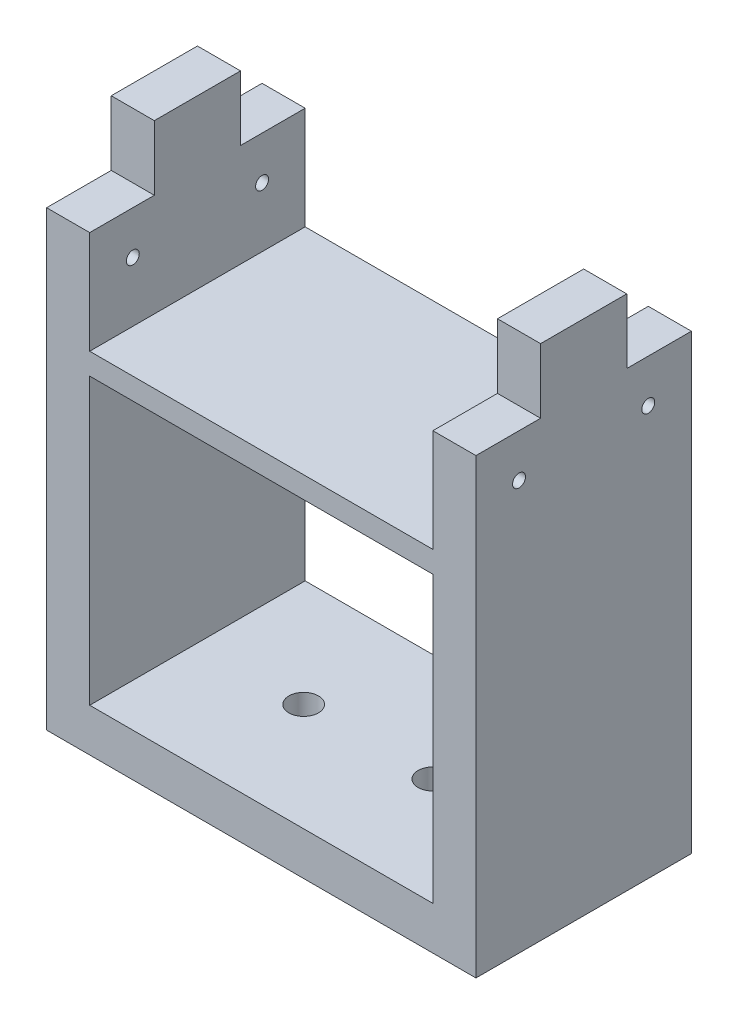
ISO-10303-21;
HEADER;
FILE_DESCRIPTION(('STEP AP214'),'2;1');
FILE_NAME('part.step','',(''),(''),'','','');
FILE_SCHEMA(('AUTOMOTIVE_DESIGN { 1 0 10303 214 1 1 1 1 }'));
ENDSEC;
DATA;
#1=APPLICATION_CONTEXT('core data for automotive mechanical design processes');
#2=APPLICATION_PROTOCOL_DEFINITION('international standard','automotive_design',2000,#1);
#3=PRODUCT_CONTEXT('',#1,'mechanical');
#4=PRODUCT('Part','Part','',(#3));
#5=PRODUCT_RELATED_PRODUCT_CATEGORY('part','',(#4));
#6=PRODUCT_DEFINITION_FORMATION('','',#4);
#7=PRODUCT_DEFINITION_CONTEXT('part definition',#1,'design');
#8=PRODUCT_DEFINITION('design','',#6,#7);
#9=PRODUCT_DEFINITION_SHAPE('','',#8);
#10=(LENGTH_UNIT() NAMED_UNIT(*) SI_UNIT(.MILLI.,.METRE.));
#11=(NAMED_UNIT(*) PLANE_ANGLE_UNIT() SI_UNIT($,.RADIAN.));
#12=(NAMED_UNIT(*) SI_UNIT($,.STERADIAN.) SOLID_ANGLE_UNIT());
#13=UNCERTAINTY_MEASURE_WITH_UNIT(LENGTH_MEASURE(1.E-05),#10,'distance_accuracy_value','');
#14=(GEOMETRIC_REPRESENTATION_CONTEXT(3) GLOBAL_UNCERTAINTY_ASSIGNED_CONTEXT((#13)) GLOBAL_UNIT_ASSIGNED_CONTEXT((#10,
#11,#12)) REPRESENTATION_CONTEXT('',''));
#15=CARTESIAN_POINT('',(0.,0.,0.));
#16=DIRECTION('',(0.,0.,1.));
#17=DIRECTION('',(1.,0.,0.));
#18=AXIS2_PLACEMENT_3D('',#15,#16,#17);
#19=CARTESIAN_POINT('',(71.8800104345077,105.,35.));
#20=DIRECTION('',(0.,-1.,0.));
#21=DIRECTION('',(1.,0.,0.));
#22=AXIS2_PLACEMENT_3D('',#19,#20,#21);
#23=PLANE('',#22);
#24=DIRECTION('',(0.,0.,-1.));
#25=VECTOR('',#24,1.);
#26=CARTESIAN_POINT('',(-30.5064857593433,105.,50.));
#27=LINE('',#26,#25);
#28=CARTESIAN_POINT('',(-30.5064857593433,105.,50.));
#29=VERTEX_POINT('',#28);
#30=CARTESIAN_POINT('',(-30.5064857593433,105.,35.));
#31=VERTEX_POINT('',#30);
#32=EDGE_CURVE('E317',#29,#31,#27,.T.);
#33=ORIENTED_EDGE('',*,*,#32,.T.);
#34=DIRECTION('',(-1.,0.,0.));
#35=VECTOR('',#34,1.);
#36=CARTESIAN_POINT('',(71.8800104345077,105.,35.));
#37=LINE('',#36,#35);
#38=CARTESIAN_POINT('',(-40.5064857593433,105.,35.));
#39=VERTEX_POINT('',#38);
#40=EDGE_CURVE('E11',#31,#39,#37,.T.);
#41=ORIENTED_EDGE('',*,*,#40,.T.);
#42=DIRECTION('',(0.,0.,-1.));
#43=VECTOR('',#42,1.);
#44=CARTESIAN_POINT('',(-40.5064857593433,105.,50.));
#45=LINE('',#44,#43);
#46=CARTESIAN_POINT('',(-40.5064857593433,105.,50.));
#47=VERTEX_POINT('',#46);
#48=EDGE_CURVE('E290',#47,#39,#45,.T.);
#49=ORIENTED_EDGE('',*,*,#48,.F.);
#50=DIRECTION('',(1.,0.,0.));
#51=VECTOR('',#50,1.);
#52=CARTESIAN_POINT('',(0.,105.,50.));
#53=LINE('',#52,#51);
#54=EDGE_CURVE('E304',#47,#29,#53,.T.);
#55=ORIENTED_EDGE('',*,*,#54,.T.);
#56=EDGE_LOOP('',(#33,#41,#49,#55));
#57=FACE_BOUND('',#56,.T.);
#58=ADVANCED_FACE('F40',(#57),#23,.F.);
#59=CARTESIAN_POINT('',(71.8800104345077,120.,35.));
#60=DIRECTION('',(0.,0.,-1.));
#61=DIRECTION('',(-1.,0.,0.));
#62=AXIS2_PLACEMENT_3D('',#59,#60,#61);
#63=PLANE('',#62);
#64=DIRECTION('',(0.,1.,0.));
#65=VECTOR('',#64,1.);
#66=CARTESIAN_POINT('',(-30.5064857593433,204.794329494483,35.));
#67=LINE('',#66,#65);
#68=CARTESIAN_POINT('',(-30.5064857593433,120.,35.));
#69=VERTEX_POINT('',#68);
#70=EDGE_CURVE('E319',#31,#69,#67,.T.);
#71=ORIENTED_EDGE('',*,*,#70,.T.);
#72=DIRECTION('',(-1.,0.,0.));
#73=VECTOR('',#72,1.);
#74=CARTESIAN_POINT('',(71.8800104345077,120.,35.));
#75=LINE('',#74,#73);
#76=CARTESIAN_POINT('',(-40.5064857593433,120.,35.));
#77=VERTEX_POINT('',#76);
#78=EDGE_CURVE('E306',#69,#77,#75,.T.);
#79=ORIENTED_EDGE('',*,*,#78,.T.);
#80=DIRECTION('',(0.,1.,0.));
#81=VECTOR('',#80,1.);
#82=CARTESIAN_POINT('',(-40.5064857593433,210.,35.));
#83=LINE('',#82,#81);
#84=EDGE_CURVE('E292',#39,#77,#83,.T.);
#85=ORIENTED_EDGE('',*,*,#84,.F.);
#86=ORIENTED_EDGE('',*,*,#40,.F.);
#87=EDGE_LOOP('',(#71,#79,#85,#86));
#88=FACE_BOUND('',#87,.T.);
#89=ADVANCED_FACE('F395',(#88),#63,.F.);
#90=CARTESIAN_POINT('',(71.8800104345077,120.,15.));
#91=DIRECTION('',(0.,-1.,0.));
#92=DIRECTION('',(1.,0.,0.));
#93=AXIS2_PLACEMENT_3D('',#90,#91,#92);
#94=PLANE('',#93);
#95=DIRECTION('',(0.,0.,-1.));
#96=VECTOR('',#95,1.);
#97=CARTESIAN_POINT('',(-30.5064857593433,120.,50.));
#98=LINE('',#97,#96);
#99=CARTESIAN_POINT('',(-30.5064857593433,120.,15.));
#100=VERTEX_POINT('',#99);
#101=EDGE_CURVE('E325',#69,#100,#98,.T.);
#102=ORIENTED_EDGE('',*,*,#101,.T.);
#103=DIRECTION('',(-1.,0.,0.));
#104=VECTOR('',#103,1.);
#105=CARTESIAN_POINT('',(71.8800104345077,120.,15.));
#106=LINE('',#105,#104);
#107=CARTESIAN_POINT('',(-40.5064857593433,120.,15.));
#108=VERTEX_POINT('',#107);
#109=EDGE_CURVE('E310',#100,#108,#106,.T.);
#110=ORIENTED_EDGE('',*,*,#109,.T.);
#111=DIRECTION('',(0.,0.,-1.));
#112=VECTOR('',#111,1.);
#113=CARTESIAN_POINT('',(-40.5064857593433,120.,50.));
#114=LINE('',#113,#112);
#115=EDGE_CURVE('E294',#77,#108,#114,.T.);
#116=ORIENTED_EDGE('',*,*,#115,.F.);
#117=ORIENTED_EDGE('',*,*,#78,.F.);
#118=EDGE_LOOP('',(#102,#110,#116,#117));
#119=FACE_BOUND('',#118,.T.);
#120=ADVANCED_FACE('F392',(#119),#94,.F.);
#121=CARTESIAN_POINT('',(71.8800104345077,105.,15.));
#122=DIRECTION('',(0.,0.,1.));
#123=DIRECTION('',(1.,0.,0.));
#124=AXIS2_PLACEMENT_3D('',#121,#122,#123);
#125=PLANE('',#124);
#126=DIRECTION('',(0.,-1.,0.));
#127=VECTOR('',#126,1.);
#128=CARTESIAN_POINT('',(-30.5064857593433,204.794329494483,15.));
#129=LINE('',#128,#127);
#130=CARTESIAN_POINT('',(-30.5064857593433,105.,15.));
#131=VERTEX_POINT('',#130);
#132=EDGE_CURVE('E329',#100,#131,#129,.T.);
#133=ORIENTED_EDGE('',*,*,#132,.T.);
#134=DIRECTION('',(-1.,0.,0.));
#135=VECTOR('',#134,1.);
#136=CARTESIAN_POINT('',(71.8800104345077,105.,15.));
#137=LINE('',#136,#135);
#138=CARTESIAN_POINT('',(-40.5064857593433,105.,15.));
#139=VERTEX_POINT('',#138);
#140=EDGE_CURVE('E314',#131,#139,#137,.T.);
#141=ORIENTED_EDGE('',*,*,#140,.T.);
#142=DIRECTION('',(0.,-1.,0.));
#143=VECTOR('',#142,1.);
#144=CARTESIAN_POINT('',(-40.5064857593433,210.,15.));
#145=LINE('',#144,#143);
#146=EDGE_CURVE('E296',#108,#139,#145,.T.);
#147=ORIENTED_EDGE('',*,*,#146,.F.);
#148=ORIENTED_EDGE('',*,*,#109,.F.);
#149=EDGE_LOOP('',(#133,#141,#147,#148));
#150=FACE_BOUND('',#149,.T.);
#151=ADVANCED_FACE('F386',(#150),#125,.F.);
#152=CARTESIAN_POINT('',(71.8800104345077,105.,0.));
#153=DIRECTION('',(0.,-1.,0.));
#154=DIRECTION('',(1.,0.,0.));
#155=AXIS2_PLACEMENT_3D('',#152,#153,#154);
#156=PLANE('',#155);
#157=DIRECTION('',(0.,0.,-1.));
#158=VECTOR('',#157,1.);
#159=CARTESIAN_POINT('',(-30.5064857593433,105.,50.));
#160=LINE('',#159,#158);
#161=CARTESIAN_POINT('',(-30.5064857593433,105.,0.));
#162=VERTEX_POINT('',#161);
#163=EDGE_CURVE('E322',#131,#162,#160,.T.);
#164=ORIENTED_EDGE('',*,*,#163,.T.);
#165=DIRECTION('',(1.,0.,0.));
#166=VECTOR('',#165,1.);
#167=CARTESIAN_POINT('',(0.,105.,0.));
#168=LINE('',#167,#166);
#169=CARTESIAN_POINT('',(-40.5064857593433,105.,0.));
#170=VERTEX_POINT('',#169);
#171=EDGE_CURVE('E302',#170,#162,#168,.T.);
#172=ORIENTED_EDGE('',*,*,#171,.F.);
#173=DIRECTION('',(0.,0.,-1.));
#174=VECTOR('',#173,1.);
#175=CARTESIAN_POINT('',(-40.5064857593433,105.,50.));
#176=LINE('',#175,#174);
#177=EDGE_CURVE('E298',#139,#170,#176,.T.);
#178=ORIENTED_EDGE('',*,*,#177,.F.);
#179=ORIENTED_EDGE('',*,*,#140,.F.);
#180=EDGE_LOOP('',(#164,#172,#178,#179));
#181=FACE_BOUND('',#180,.T.);
#182=ADVANCED_FACE('F339',(#181),#156,.F.);
#183=DIRECTION('',(0.,0.,1.));
#184=VECTOR('',#183,1.);
#185=CARTESIAN_POINT('',(49.130974017595,105.,50.));
#186=LINE('',#185,#184);
#187=CARTESIAN_POINT('',(49.130974017595,105.,0.));
#188=VERTEX_POINT('',#187);
#189=CARTESIAN_POINT('',(49.130974017595,105.,15.));
#190=VERTEX_POINT('',#189);
#191=EDGE_CURVE('E44',#188,#190,#186,.T.);
#192=ORIENTED_EDGE('',*,*,#191,.T.);
#193=CARTESIAN_POINT('',(59.130974017595,105.,15.));
#194=VERTEX_POINT('',#193);
#195=EDGE_CURVE('E303',#194,#190,#137,.T.);
#196=ORIENTED_EDGE('',*,*,#195,.F.);
#197=DIRECTION('',(0.,0.,1.));
#198=VECTOR('',#197,1.);
#199=CARTESIAN_POINT('',(59.130974017595,105.,50.));
#200=LINE('',#199,#198);
#201=CARTESIAN_POINT('',(59.130974017595,105.,0.));
#202=VERTEX_POINT('',#201);
#203=EDGE_CURVE('E288',#202,#194,#200,.T.);
#204=ORIENTED_EDGE('',*,*,#203,.F.);
#205=EDGE_CURVE('E300',#188,#202,#168,.T.);
#206=ORIENTED_EDGE('',*,*,#205,.F.);
#207=EDGE_LOOP('',(#192,#196,#204,#206));
#208=FACE_BOUND('',#207,.T.);
#209=ADVANCED_FACE('F42',(#208),#156,.F.);
#210=DIRECTION('',(0.,1.,0.));
#211=VECTOR('',#210,1.);
#212=CARTESIAN_POINT('',(49.130974017595,10.,15.));
#213=LINE('',#212,#211);
#214=CARTESIAN_POINT('',(49.130974017595,120.,15.));
#215=VERTEX_POINT('',#214);
#216=EDGE_CURVE('E331',#190,#215,#213,.T.);
#217=ORIENTED_EDGE('',*,*,#216,.T.);
#218=CARTESIAN_POINT('',(59.130974017595,120.,15.));
#219=VERTEX_POINT('',#218);
#220=EDGE_CURVE('E313',#219,#215,#106,.T.);
#221=ORIENTED_EDGE('',*,*,#220,.F.);
#222=DIRECTION('',(0.,1.,0.));
#223=VECTOR('',#222,1.);
#224=CARTESIAN_POINT('',(59.130974017595,0.,15.));
#225=LINE('',#224,#223);
#226=EDGE_CURVE('E286',#194,#219,#225,.T.);
#227=ORIENTED_EDGE('',*,*,#226,.F.);
#228=ORIENTED_EDGE('',*,*,#195,.T.);
#229=EDGE_LOOP('',(#217,#221,#227,#228));
#230=FACE_BOUND('',#229,.T.);
#231=ADVANCED_FACE('F357',(#230),#125,.F.);
#232=DIRECTION('',(0.,0.,1.));
#233=VECTOR('',#232,1.);
#234=CARTESIAN_POINT('',(49.130974017595,120.,50.));
#235=LINE('',#234,#233);
#236=CARTESIAN_POINT('',(49.130974017595,120.,35.));
#237=VERTEX_POINT('',#236);
#238=EDGE_CURVE('E327',#215,#237,#235,.T.);
#239=ORIENTED_EDGE('',*,*,#238,.T.);
#240=CARTESIAN_POINT('',(59.130974017595,120.,35.));
#241=VERTEX_POINT('',#240);
#242=EDGE_CURVE('E309',#241,#237,#75,.T.);
#243=ORIENTED_EDGE('',*,*,#242,.F.);
#244=DIRECTION('',(0.,0.,1.));
#245=VECTOR('',#244,1.);
#246=CARTESIAN_POINT('',(59.130974017595,120.,50.));
#247=LINE('',#246,#245);
#248=EDGE_CURVE('E62',#219,#241,#247,.T.);
#249=ORIENTED_EDGE('',*,*,#248,.F.);
#250=ORIENTED_EDGE('',*,*,#220,.T.);
#251=EDGE_LOOP('',(#239,#243,#249,#250));
#252=FACE_BOUND('',#251,.T.);
#253=ADVANCED_FACE('F364',(#252),#94,.F.);
#254=DIRECTION('',(0.,-1.,0.));
#255=VECTOR('',#254,1.);
#256=CARTESIAN_POINT('',(49.130974017595,10.,35.));
#257=LINE('',#256,#255);
#258=CARTESIAN_POINT('',(49.130974017595,105.,35.));
#259=VERTEX_POINT('',#258);
#260=EDGE_CURVE('E323',#237,#259,#257,.T.);
#261=ORIENTED_EDGE('',*,*,#260,.T.);
#262=CARTESIAN_POINT('',(59.130974017595,105.,35.));
#263=VERTEX_POINT('',#262);
#264=EDGE_CURVE('E49',#263,#259,#37,.T.);
#265=ORIENTED_EDGE('',*,*,#264,.F.);
#266=DIRECTION('',(0.,-1.,0.));
#267=VECTOR('',#266,1.);
#268=CARTESIAN_POINT('',(59.130974017595,0.,35.));
#269=LINE('',#268,#267);
#270=EDGE_CURVE('E57',#241,#263,#269,.T.);
#271=ORIENTED_EDGE('',*,*,#270,.F.);
#272=ORIENTED_EDGE('',*,*,#242,.T.);
#273=EDGE_LOOP('',(#261,#265,#271,#272));
#274=FACE_BOUND('',#273,.T.);
#275=ADVANCED_FACE('F366',(#274),#63,.F.);
#276=DIRECTION('',(0.,0.,1.));
#277=VECTOR('',#276,1.);
#278=CARTESIAN_POINT('',(49.130974017595,105.,50.));
#279=LINE('',#278,#277);
#280=CARTESIAN_POINT('',(49.130974017595,105.,50.));
#281=VERTEX_POINT('',#280);
#282=EDGE_CURVE('E320',#259,#281,#279,.T.);
#283=ORIENTED_EDGE('',*,*,#282,.T.);
#284=CARTESIAN_POINT('',(59.130974017595,105.,50.));
#285=VERTEX_POINT('',#284);
#286=EDGE_CURVE('E187',#281,#285,#53,.T.);
#287=ORIENTED_EDGE('',*,*,#286,.T.);
#288=DIRECTION('',(0.,0.,1.));
#289=VECTOR('',#288,1.);
#290=CARTESIAN_POINT('',(59.130974017595,105.,50.));
#291=LINE('',#290,#289);
#292=EDGE_CURVE('E272',#263,#285,#291,.T.);
#293=ORIENTED_EDGE('',*,*,#292,.F.);
#294=ORIENTED_EDGE('',*,*,#264,.T.);
#295=EDGE_LOOP('',(#283,#287,#293,#294));
#296=FACE_BOUND('',#295,.T.);
#297=ADVANCED_FACE('F370',(#296),#23,.F.);
#298=CARTESIAN_POINT('',(24.130974017595,0.,25.));
#299=DIRECTION('',(0.,1.,0.));
#300=DIRECTION('',(0.,0.,1.));
#301=AXIS2_PLACEMENT_3D('',#298,#299,#300);
#302=CYLINDRICAL_SURFACE('',#301,3.425);
#303=CARTESIAN_POINT('',(24.130974017595,0.,25.));
#304=DIRECTION('',(0.,1.,0.));
#305=DIRECTION('',(0.,0.,1.));
#306=AXIS2_PLACEMENT_3D('',#303,#304,#305);
#307=CIRCLE('',#306,3.425);
#308=CARTESIAN_POINT('',(24.130974017595,0.,28.425));
#309=VERTEX_POINT('',#308);
#310=EDGE_CURVE('E214',#309,#309,#307,.T.);
#311=ORIENTED_EDGE('',*,*,#310,.F.);
#312=EDGE_LOOP('',(#311));
#313=FACE_BOUND('',#312,.T.);
#314=CARTESIAN_POINT('',(24.130974017595,10.,25.));
#315=DIRECTION('',(0.,1.,0.));
#316=DIRECTION('',(0.,0.,1.));
#317=AXIS2_PLACEMENT_3D('',#314,#315,#316);
#318=CIRCLE('',#317,3.425);
#319=CARTESIAN_POINT('',(24.130974017595,10.,28.425));
#320=VERTEX_POINT('',#319);
#321=EDGE_CURVE('E229',#320,#320,#318,.T.);
#322=ORIENTED_EDGE('',*,*,#321,.T.);
#323=EDGE_LOOP('',(#322));
#324=FACE_BOUND('',#323,.T.);
#325=ADVANCED_FACE('F408',(#313,#324),#302,.F.);
#326=CARTESIAN_POINT('',(-5.85128713251137,0.,25.));
#327=DIRECTION('',(0.,1.,0.));
#328=DIRECTION('',(0.,0.,1.));
#329=AXIS2_PLACEMENT_3D('',#326,#327,#328);
#330=CYLINDRICAL_SURFACE('',#329,3.425);
#331=CARTESIAN_POINT('',(-5.85128713251137,0.,25.));
#332=DIRECTION('',(0.,1.,0.));
#333=DIRECTION('',(0.,0.,1.));
#334=AXIS2_PLACEMENT_3D('',#331,#332,#333);
#335=CIRCLE('',#334,3.425);
#336=CARTESIAN_POINT('',(-5.85128713251137,0.,28.425));
#337=VERTEX_POINT('',#336);
#338=EDGE_CURVE('E223',#337,#337,#335,.T.);
#339=ORIENTED_EDGE('',*,*,#338,.F.);
#340=EDGE_LOOP('',(#339));
#341=FACE_BOUND('',#340,.T.);
#342=CARTESIAN_POINT('',(-5.85128713251137,10.,25.));
#343=DIRECTION('',(0.,1.,0.));
#344=DIRECTION('',(0.,0.,1.));
#345=AXIS2_PLACEMENT_3D('',#342,#343,#344);
#346=CIRCLE('',#345,3.425);
#347=CARTESIAN_POINT('',(-5.85128713251137,10.,28.425));
#348=VERTEX_POINT('',#347);
#349=EDGE_CURVE('E226',#348,#348,#346,.T.);
#350=ORIENTED_EDGE('',*,*,#349,.T.);
#351=EDGE_LOOP('',(#350));
#352=FACE_BOUND('',#351,.T.);
#353=ADVANCED_FACE('F414',(#341,#352),#330,.F.);
#354=CARTESIAN_POINT('',(-30.5064857593433,10.,50.));
#355=DIRECTION('',(0.,1.,0.));
#356=DIRECTION('',(0.,0.,1.));
#357=AXIS2_PLACEMENT_3D('',#354,#355,#356);
#358=PLANE('',#357);
#359=ORIENTED_EDGE('',*,*,#349,.F.);
#360=EDGE_LOOP('',(#359));
#361=FACE_BOUND('',#360,.T.);
#362=ORIENTED_EDGE('',*,*,#321,.F.);
#363=EDGE_LOOP('',(#362));
#364=FACE_BOUND('',#363,.T.);
#365=DIRECTION('',(1.,0.,0.));
#366=VECTOR('',#365,1.);
#367=CARTESIAN_POINT('',(-30.5064857593433,10.,0.));
#368=LINE('',#367,#366);
#369=CARTESIAN_POINT('',(-30.5064857593433,10.,0.));
#370=VERTEX_POINT('',#369);
#371=CARTESIAN_POINT('',(49.130974017595,10.,0.));
#372=VERTEX_POINT('',#371);
#373=EDGE_CURVE('E192',#370,#372,#368,.T.);
#374=ORIENTED_EDGE('',*,*,#373,.F.);
#375=DIRECTION('',(0.,0.,-1.));
#376=VECTOR('',#375,1.);
#377=CARTESIAN_POINT('',(-30.5064857593433,10.,50.));
#378=LINE('',#377,#376);
#379=CARTESIAN_POINT('',(-30.5064857593433,10.,50.));
#380=VERTEX_POINT('',#379);
#381=EDGE_CURVE('E250',#380,#370,#378,.T.);
#382=ORIENTED_EDGE('',*,*,#381,.F.);
#383=DIRECTION('',(1.,0.,0.));
#384=VECTOR('',#383,1.);
#385=CARTESIAN_POINT('',(-30.5064857593433,10.,50.));
#386=LINE('',#385,#384);
#387=CARTESIAN_POINT('',(49.130974017595,10.,50.));
#388=VERTEX_POINT('',#387);
#389=EDGE_CURVE('E237',#380,#388,#386,.T.);
#390=ORIENTED_EDGE('',*,*,#389,.T.);
#391=DIRECTION('',(0.,0.,-1.));
#392=VECTOR('',#391,1.);
#393=CARTESIAN_POINT('',(49.130974017595,10.,50.));
#394=LINE('',#393,#392);
#395=EDGE_CURVE('E239',#388,#372,#394,.T.);
#396=ORIENTED_EDGE('',*,*,#395,.T.);
#397=EDGE_LOOP('',(#374,#382,#390,#396));
#398=FACE_BOUND('',#397,.T.);
#399=ADVANCED_FACE('F449',(#361,#364,#398),#358,.T.);
#400=CARTESIAN_POINT('',(-30.5064857593433,204.794329494483,50.));
#401=DIRECTION('',(1.,0.,0.));
#402=DIRECTION('',(0.,0.,-1.));
#403=AXIS2_PLACEMENT_3D('',#400,#401,#402);
#404=PLANE('',#403);
#405=DIRECTION('',(0.,0.,1.));
#406=VECTOR('',#405,1.);
#407=CARTESIAN_POINT('',(-30.5064857593433,76.1512971011657,0.));
#408=LINE('',#407,#406);
#409=CARTESIAN_POINT('',(-30.5064857593433,76.1512971011657,0.));
#410=VERTEX_POINT('',#409);
#411=CARTESIAN_POINT('',(-30.5064857593433,76.1512971011657,50.));
#412=VERTEX_POINT('',#411);
#413=EDGE_CURVE('E221',#410,#412,#408,.T.);
#414=ORIENTED_EDGE('',*,*,#413,.T.);
#415=DIRECTION('',(0.,-1.,0.));
#416=VECTOR('',#415,1.);
#417=CARTESIAN_POINT('',(-30.5064857593433,204.794329494483,50.));
#418=LINE('',#417,#416);
#419=EDGE_CURVE('E234',#412,#380,#418,.T.);
#420=ORIENTED_EDGE('',*,*,#419,.T.);
#421=ORIENTED_EDGE('',*,*,#381,.T.);
#422=DIRECTION('',(0.,-1.,0.));
#423=VECTOR('',#422,1.);
#424=CARTESIAN_POINT('',(-30.5064857593433,204.794329494483,0.));
#425=LINE('',#424,#423);
#426=EDGE_CURVE('E243',#410,#370,#425,.T.);
#427=ORIENTED_EDGE('',*,*,#426,.F.);
#428=EDGE_LOOP('',(#414,#420,#421,#427));
#429=FACE_BOUND('',#428,.T.);
#430=ADVANCED_FACE('F446',(#429),#404,.T.);
#431=CARTESIAN_POINT('',(49.130974017595,76.1512971011657,0.));
#432=DIRECTION('',(0.,-1.,0.));
#433=DIRECTION('',(1.,0.,0.));
#434=AXIS2_PLACEMENT_3D('',#431,#432,#433);
#435=PLANE('',#434);
#436=DIRECTION('',(1.,0.,0.));
#437=VECTOR('',#436,1.);
#438=CARTESIAN_POINT('',(49.130974017595,76.1512971011657,50.));
#439=LINE('',#438,#437);
#440=CARTESIAN_POINT('',(49.130974017595,76.1512971011657,50.));
#441=VERTEX_POINT('',#440);
#442=EDGE_CURVE('E210',#412,#441,#439,.T.);
#443=ORIENTED_EDGE('',*,*,#442,.F.);
#444=ORIENTED_EDGE('',*,*,#413,.F.);
#445=DIRECTION('',(1.,0.,0.));
#446=VECTOR('',#445,1.);
#447=CARTESIAN_POINT('',(49.130974017595,76.1512971011657,0.));
#448=LINE('',#447,#446);
#449=CARTESIAN_POINT('',(49.130974017595,76.1512971011657,0.));
#450=VERTEX_POINT('',#449);
#451=EDGE_CURVE('E211',#410,#450,#448,.T.);
#452=ORIENTED_EDGE('',*,*,#451,.T.);
#453=DIRECTION('',(0.,0.,1.));
#454=VECTOR('',#453,1.);
#455=CARTESIAN_POINT('',(49.130974017595,76.1512971011657,0.));
#456=LINE('',#455,#454);
#457=EDGE_CURVE('E204',#450,#441,#456,.T.);
#458=ORIENTED_EDGE('',*,*,#457,.T.);
#459=EDGE_LOOP('',(#443,#444,#452,#458));
#460=FACE_BOUND('',#459,.T.);
#461=ADVANCED_FACE('F444',(#460),#435,.T.);
#462=CARTESIAN_POINT('',(49.130974017595,10.,50.));
#463=DIRECTION('',(-1.,0.,0.));
#464=DIRECTION('',(0.,0.,1.));
#465=AXIS2_PLACEMENT_3D('',#462,#463,#464);
#466=PLANE('',#465);
#467=ORIENTED_EDGE('',*,*,#457,.F.);
#468=DIRECTION('',(0.,1.,0.));
#469=VECTOR('',#468,1.);
#470=CARTESIAN_POINT('',(49.130974017595,10.,0.));
#471=LINE('',#470,#469);
#472=EDGE_CURVE('E240',#372,#450,#471,.T.);
#473=ORIENTED_EDGE('',*,*,#472,.F.);
#474=ORIENTED_EDGE('',*,*,#395,.F.);
#475=DIRECTION('',(0.,1.,0.));
#476=VECTOR('',#475,1.);
#477=CARTESIAN_POINT('',(49.130974017595,10.,50.));
#478=LINE('',#477,#476);
#479=EDGE_CURVE('E191',#388,#441,#478,.T.);
#480=ORIENTED_EDGE('',*,*,#479,.T.);
#481=EDGE_LOOP('',(#467,#473,#474,#480));
#482=FACE_BOUND('',#481,.T.);
#483=ADVANCED_FACE('F441',(#482),#466,.T.);
#484=ORIENTED_EDGE('',*,*,#191,.F.);
#485=CARTESIAN_POINT('',(49.130974017595,81.1512971011657,0.));
#486=VERTEX_POINT('',#485);
#487=EDGE_CURVE('E200',#486,#188,#471,.T.);
#488=ORIENTED_EDGE('',*,*,#487,.F.);
#489=DIRECTION('',(0.,0.,1.));
#490=VECTOR('',#489,1.);
#491=CARTESIAN_POINT('',(49.130974017595,81.1512971011657,0.));
#492=LINE('',#491,#490);
#493=CARTESIAN_POINT('',(49.130974017595,81.1512971011657,50.));
#494=VERTEX_POINT('',#493);
#495=EDGE_CURVE('E195',#486,#494,#492,.T.);
#496=ORIENTED_EDGE('',*,*,#495,.T.);
#497=EDGE_CURVE('E178',#494,#281,#478,.T.);
#498=ORIENTED_EDGE('',*,*,#497,.T.);
#499=ORIENTED_EDGE('',*,*,#282,.F.);
#500=ORIENTED_EDGE('',*,*,#260,.F.);
#501=ORIENTED_EDGE('',*,*,#238,.F.);
#502=ORIENTED_EDGE('',*,*,#216,.F.);
#503=EDGE_LOOP('',(#484,#488,#496,#498,#499,#500,#501,#502));
#504=FACE_BOUND('',#503,.T.);
#505=CARTESIAN_POINT('',(49.130974017595,95.,10.));
#506=DIRECTION('',(-1.,0.,0.));
#507=DIRECTION('',(0.,0.,1.));
#508=AXIS2_PLACEMENT_3D('',#505,#506,#507);
#509=CIRCLE('',#508,1.5);
#510=CARTESIAN_POINT('',(49.130974017595,95.,11.5));
#511=VERTEX_POINT('',#510);
#512=EDGE_CURVE('E487',#511,#511,#509,.T.);
#513=ORIENTED_EDGE('',*,*,#512,.F.);
#514=EDGE_LOOP('',(#513));
#515=FACE_BOUND('',#514,.T.);
#516=CARTESIAN_POINT('',(49.130974017595,95.,40.));
#517=DIRECTION('',(-1.,0.,0.));
#518=DIRECTION('',(0.,0.,1.));
#519=AXIS2_PLACEMENT_3D('',#516,#517,#518);
#520=CIRCLE('',#519,1.5);
#521=CARTESIAN_POINT('',(49.130974017595,95.,41.5));
#522=VERTEX_POINT('',#521);
#523=EDGE_CURVE('E282',#522,#522,#520,.T.);
#524=ORIENTED_EDGE('',*,*,#523,.F.);
#525=EDGE_LOOP('',(#524));
#526=FACE_BOUND('',#525,.T.);
#527=ADVANCED_FACE('F197',(#504,#515,#526),#466,.T.);
#528=CARTESIAN_POINT('',(-30.5064857593433,81.1512971011657,0.));
#529=DIRECTION('',(0.,1.,0.));
#530=DIRECTION('',(-1.,0.,0.));
#531=AXIS2_PLACEMENT_3D('',#528,#529,#530);
#532=PLANE('',#531);
#533=DIRECTION('',(-1.,0.,0.));
#534=VECTOR('',#533,1.);
#535=CARTESIAN_POINT('',(-30.5064857593433,81.1512971011657,50.));
#536=LINE('',#535,#534);
#537=CARTESIAN_POINT('',(-30.5064857593433,81.1512971011657,50.));
#538=VERTEX_POINT('',#537);
#539=EDGE_CURVE('E184',#494,#538,#536,.T.);
#540=ORIENTED_EDGE('',*,*,#539,.F.);
#541=ORIENTED_EDGE('',*,*,#495,.F.);
#542=DIRECTION('',(-1.,0.,0.));
#543=VECTOR('',#542,1.);
#544=CARTESIAN_POINT('',(-30.5064857593433,81.1512971011657,0.));
#545=LINE('',#544,#543);
#546=CARTESIAN_POINT('',(-30.5064857593433,81.1512971011657,0.));
#547=VERTEX_POINT('',#546);
#548=EDGE_CURVE('E217',#486,#547,#545,.T.);
#549=ORIENTED_EDGE('',*,*,#548,.T.);
#550=DIRECTION('',(0.,0.,1.));
#551=VECTOR('',#550,1.);
#552=CARTESIAN_POINT('',(-30.5064857593433,81.1512971011657,0.));
#553=LINE('',#552,#551);
#554=EDGE_CURVE('E205',#547,#538,#553,.T.);
#555=ORIENTED_EDGE('',*,*,#554,.T.);
#556=EDGE_LOOP('',(#540,#541,#549,#555));
#557=FACE_BOUND('',#556,.T.);
#558=ADVANCED_FACE('F208',(#557),#532,.T.);
#559=ORIENTED_EDGE('',*,*,#163,.F.);
#560=ORIENTED_EDGE('',*,*,#132,.F.);
#561=ORIENTED_EDGE('',*,*,#101,.F.);
#562=ORIENTED_EDGE('',*,*,#70,.F.);
#563=ORIENTED_EDGE('',*,*,#32,.F.);
#564=EDGE_CURVE('E235',#29,#538,#418,.T.);
#565=ORIENTED_EDGE('',*,*,#564,.T.);
#566=ORIENTED_EDGE('',*,*,#554,.F.);
#567=EDGE_CURVE('E244',#162,#547,#425,.T.);
#568=ORIENTED_EDGE('',*,*,#567,.F.);
#569=EDGE_LOOP('',(#559,#560,#561,#562,#563,#565,#566,#568));
#570=FACE_BOUND('',#569,.T.);
#571=CARTESIAN_POINT('',(-30.5064857593433,95.,10.));
#572=DIRECTION('',(1.,0.,0.));
#573=DIRECTION('',(0.,0.,-1.));
#574=AXIS2_PLACEMENT_3D('',#571,#572,#573);
#575=CIRCLE('',#574,1.5);
#576=CARTESIAN_POINT('',(-30.5064857593433,95.,8.5));
#577=VERTEX_POINT('',#576);
#578=EDGE_CURVE('E281',#577,#577,#575,.T.);
#579=ORIENTED_EDGE('',*,*,#578,.F.);
#580=EDGE_LOOP('',(#579));
#581=FACE_BOUND('',#580,.T.);
#582=CARTESIAN_POINT('',(-30.5064857593433,95.,40.));
#583=DIRECTION('',(1.,0.,0.));
#584=DIRECTION('',(0.,0.,-1.));
#585=AXIS2_PLACEMENT_3D('',#582,#583,#584);
#586=CIRCLE('',#585,1.5);
#587=CARTESIAN_POINT('',(-30.5064857593433,95.,38.5));
#588=VERTEX_POINT('',#587);
#589=EDGE_CURVE('E276',#588,#588,#586,.T.);
#590=ORIENTED_EDGE('',*,*,#589,.F.);
#591=EDGE_LOOP('',(#590));
#592=FACE_BOUND('',#591,.T.);
#593=ADVANCED_FACE('F344',(#570,#581,#592),#404,.T.);
#594=CARTESIAN_POINT('',(-40.5064857593433,0.,50.));
#595=DIRECTION('',(0.,1.,0.));
#596=DIRECTION('',(-1.,0.,0.));
#597=AXIS2_PLACEMENT_3D('',#594,#595,#596);
#598=PLANE('',#597);
#599=ORIENTED_EDGE('',*,*,#338,.T.);
#600=EDGE_LOOP('',(#599));
#601=FACE_BOUND('',#600,.T.);
#602=ORIENTED_EDGE('',*,*,#310,.T.);
#603=EDGE_LOOP('',(#602));
#604=FACE_BOUND('',#603,.T.);
#605=DIRECTION('',(1.,0.,0.));
#606=VECTOR('',#605,1.);
#607=CARTESIAN_POINT('',(-40.5064857593433,0.,0.));
#608=LINE('',#607,#606);
#609=CARTESIAN_POINT('',(-40.5064857593433,0.,0.));
#610=VERTEX_POINT('',#609);
#611=CARTESIAN_POINT('',(59.130974017595,0.,0.));
#612=VERTEX_POINT('',#611);
#613=EDGE_CURVE('E263',#610,#612,#608,.T.);
#614=ORIENTED_EDGE('',*,*,#613,.T.);
#615=DIRECTION('',(0.,0.,-1.));
#616=VECTOR('',#615,1.);
#617=CARTESIAN_POINT('',(59.130974017595,0.,50.));
#618=LINE('',#617,#616);
#619=CARTESIAN_POINT('',(59.130974017595,0.,50.));
#620=VERTEX_POINT('',#619);
#621=EDGE_CURVE('E261',#620,#612,#618,.T.);
#622=ORIENTED_EDGE('',*,*,#621,.F.);
#623=DIRECTION('',(1.,0.,0.));
#624=VECTOR('',#623,1.);
#625=CARTESIAN_POINT('',(-40.5064857593433,0.,50.));
#626=LINE('',#625,#624);
#627=CARTESIAN_POINT('',(-40.5064857593433,0.,50.));
#628=VERTEX_POINT('',#627);
#629=EDGE_CURVE('E256',#628,#620,#626,.T.);
#630=ORIENTED_EDGE('',*,*,#629,.F.);
#631=DIRECTION('',(0.,0.,-1.));
#632=VECTOR('',#631,1.);
#633=CARTESIAN_POINT('',(-40.5064857593433,0.,50.));
#634=LINE('',#633,#632);
#635=EDGE_CURVE('E269',#628,#610,#634,.T.);
#636=ORIENTED_EDGE('',*,*,#635,.T.);
#637=EDGE_LOOP('',(#614,#622,#630,#636));
#638=FACE_BOUND('',#637,.T.);
#639=ADVANCED_FACE('F379',(#601,#604,#638),#598,.F.);
#640=CARTESIAN_POINT('',(0.,0.,50.));
#641=DIRECTION('',(0.,0.,1.));
#642=DIRECTION('',(1.,0.,0.));
#643=AXIS2_PLACEMENT_3D('',#640,#641,#642);
#644=PLANE('',#643);
#645=ORIENTED_EDGE('',*,*,#54,.F.);
#646=DIRECTION('',(0.,-1.,0.));
#647=VECTOR('',#646,1.);
#648=CARTESIAN_POINT('',(-40.5064857593433,210.,50.));
#649=LINE('',#648,#647);
#650=EDGE_CURVE('E254',#47,#628,#649,.T.);
#651=ORIENTED_EDGE('',*,*,#650,.T.);
#652=ORIENTED_EDGE('',*,*,#629,.T.);
#653=DIRECTION('',(0.,1.,0.));
#654=VECTOR('',#653,1.);
#655=CARTESIAN_POINT('',(59.130974017595,0.,50.));
#656=LINE('',#655,#654);
#657=EDGE_CURVE('E259',#620,#285,#656,.T.);
#658=ORIENTED_EDGE('',*,*,#657,.T.);
#659=ORIENTED_EDGE('',*,*,#286,.F.);
#660=ORIENTED_EDGE('',*,*,#497,.F.);
#661=ORIENTED_EDGE('',*,*,#539,.T.);
#662=ORIENTED_EDGE('',*,*,#564,.F.);
#663=EDGE_LOOP('',(#645,#651,#652,#658,#659,#660,#661,#662));
#664=FACE_BOUND('',#663,.T.);
#665=ORIENTED_EDGE('',*,*,#442,.T.);
#666=ORIENTED_EDGE('',*,*,#479,.F.);
#667=ORIENTED_EDGE('',*,*,#389,.F.);
#668=ORIENTED_EDGE('',*,*,#419,.F.);
#669=EDGE_LOOP('',(#665,#666,#667,#668));
#670=FACE_BOUND('',#669,.T.);
#671=ADVANCED_FACE('F180',(#664,#670),#644,.T.);
#672=CARTESIAN_POINT('',(0.,0.,0.));
#673=DIRECTION('',(0.,0.,1.));
#674=DIRECTION('',(1.,0.,0.));
#675=AXIS2_PLACEMENT_3D('',#672,#673,#674);
#676=PLANE('',#675);
#677=DIRECTION('',(0.,-1.,0.));
#678=VECTOR('',#677,1.);
#679=CARTESIAN_POINT('',(-40.5064857593433,210.,0.));
#680=LINE('',#679,#678);
#681=EDGE_CURVE('E253',#170,#610,#680,.T.);
#682=ORIENTED_EDGE('',*,*,#681,.F.);
#683=ORIENTED_EDGE('',*,*,#171,.T.);
#684=ORIENTED_EDGE('',*,*,#567,.T.);
#685=ORIENTED_EDGE('',*,*,#548,.F.);
#686=ORIENTED_EDGE('',*,*,#487,.T.);
#687=ORIENTED_EDGE('',*,*,#205,.T.);
#688=DIRECTION('',(0.,1.,0.));
#689=VECTOR('',#688,1.);
#690=CARTESIAN_POINT('',(59.130974017595,0.,0.));
#691=LINE('',#690,#689);
#692=EDGE_CURVE('E257',#612,#202,#691,.T.);
#693=ORIENTED_EDGE('',*,*,#692,.F.);
#694=ORIENTED_EDGE('',*,*,#613,.F.);
#695=EDGE_LOOP('',(#682,#683,#684,#685,#686,#687,#693,#694));
#696=FACE_BOUND('',#695,.T.);
#697=ORIENTED_EDGE('',*,*,#472,.T.);
#698=ORIENTED_EDGE('',*,*,#451,.F.);
#699=ORIENTED_EDGE('',*,*,#426,.T.);
#700=ORIENTED_EDGE('',*,*,#373,.T.);
#701=EDGE_LOOP('',(#697,#698,#699,#700));
#702=FACE_BOUND('',#701,.T.);
#703=ADVANCED_FACE('F347',(#696,#702),#676,.F.);
#704=CARTESIAN_POINT('',(71.8700104345077,95.,40.));
#705=DIRECTION('',(-1.,0.,0.));
#706=DIRECTION('',(0.,-1.,0.));
#707=AXIS2_PLACEMENT_3D('',#704,#705,#706);
#708=CYLINDRICAL_SURFACE('',#707,1.5);
#709=ORIENTED_EDGE('',*,*,#523,.T.);
#710=EDGE_LOOP('',(#709));
#711=FACE_BOUND('',#710,.T.);
#712=CARTESIAN_POINT('',(59.130974017595,95.,40.));
#713=DIRECTION('',(-1.,0.,0.));
#714=DIRECTION('',(0.,-1.,0.));
#715=AXIS2_PLACEMENT_3D('',#712,#713,#714);
#716=CIRCLE('',#715,1.5);
#717=CARTESIAN_POINT('',(59.130974017595,93.5,40.));
#718=VERTEX_POINT('',#717);
#719=EDGE_CURVE('E273',#718,#718,#716,.T.);
#720=ORIENTED_EDGE('',*,*,#719,.F.);
#721=EDGE_LOOP('',(#720));
#722=FACE_BOUND('',#721,.T.);
#723=ADVANCED_FACE('F438',(#711,#722),#708,.F.);
#724=CARTESIAN_POINT('',(71.8700104345077,95.,10.));
#725=DIRECTION('',(-1.,0.,0.));
#726=DIRECTION('',(0.,-1.,0.));
#727=AXIS2_PLACEMENT_3D('',#724,#725,#726);
#728=CYLINDRICAL_SURFACE('',#727,1.5);
#729=ORIENTED_EDGE('',*,*,#512,.T.);
#730=EDGE_LOOP('',(#729));
#731=FACE_BOUND('',#730,.T.);
#732=CARTESIAN_POINT('',(59.130974017595,95.,10.));
#733=DIRECTION('',(-1.,0.,0.));
#734=DIRECTION('',(0.,-1.,0.));
#735=AXIS2_PLACEMENT_3D('',#732,#733,#734);
#736=CIRCLE('',#735,1.5);
#737=CARTESIAN_POINT('',(59.130974017595,93.5,10.));
#738=VERTEX_POINT('',#737);
#739=EDGE_CURVE('E278',#738,#738,#736,.T.);
#740=ORIENTED_EDGE('',*,*,#739,.F.);
#741=EDGE_LOOP('',(#740));
#742=FACE_BOUND('',#741,.T.);
#743=ADVANCED_FACE('F427',(#731,#742),#728,.F.);
#744=CARTESIAN_POINT('',(59.130974017595,0.,50.));
#745=DIRECTION('',(-1.,0.,0.));
#746=DIRECTION('',(0.,-1.,0.));
#747=AXIS2_PLACEMENT_3D('',#744,#745,#746);
#748=PLANE('',#747);
#749=ORIENTED_EDGE('',*,*,#739,.T.);
#750=EDGE_LOOP('',(#749));
#751=FACE_BOUND('',#750,.T.);
#752=ORIENTED_EDGE('',*,*,#719,.T.);
#753=EDGE_LOOP('',(#752));
#754=FACE_BOUND('',#753,.T.);
#755=ORIENTED_EDGE('',*,*,#692,.T.);
#756=ORIENTED_EDGE('',*,*,#203,.T.);
#757=ORIENTED_EDGE('',*,*,#226,.T.);
#758=ORIENTED_EDGE('',*,*,#248,.T.);
#759=ORIENTED_EDGE('',*,*,#270,.T.);
#760=ORIENTED_EDGE('',*,*,#292,.T.);
#761=ORIENTED_EDGE('',*,*,#657,.F.);
#762=ORIENTED_EDGE('',*,*,#621,.T.);
#763=EDGE_LOOP('',(#755,#756,#757,#758,#759,#760,#761,#762));
#764=FACE_BOUND('',#763,.T.);
#765=ADVANCED_FACE('F372',(#751,#754,#764),#748,.F.);
#766=ORIENTED_EDGE('',*,*,#589,.T.);
#767=EDGE_LOOP('',(#766));
#768=FACE_BOUND('',#767,.T.);
#769=CARTESIAN_POINT('',(-40.5064857593433,95.,40.));
#770=DIRECTION('',(-1.,0.,0.));
#771=DIRECTION('',(0.,-1.,0.));
#772=AXIS2_PLACEMENT_3D('',#769,#770,#771);
#773=CIRCLE('',#772,1.5);
#774=CARTESIAN_POINT('',(-40.5064857593433,93.5,40.));
#775=VERTEX_POINT('',#774);
#776=EDGE_CURVE('E277',#775,#775,#773,.T.);
#777=ORIENTED_EDGE('',*,*,#776,.T.);
#778=EDGE_LOOP('',(#777));
#779=FACE_BOUND('',#778,.T.);
#780=ADVANCED_FACE('F424',(#768,#779),#708,.F.);
#781=ORIENTED_EDGE('',*,*,#578,.T.);
#782=EDGE_LOOP('',(#781));
#783=FACE_BOUND('',#782,.T.);
#784=CARTESIAN_POINT('',(-40.5064857593433,95.,10.));
#785=DIRECTION('',(-1.,0.,0.));
#786=DIRECTION('',(0.,1.,0.));
#787=AXIS2_PLACEMENT_3D('',#784,#785,#786);
#788=CIRCLE('',#787,1.5);
#789=CARTESIAN_POINT('',(-40.5064857593433,96.5,10.));
#790=VERTEX_POINT('',#789);
#791=EDGE_CURVE('E478',#790,#790,#788,.T.);
#792=ORIENTED_EDGE('',*,*,#791,.T.);
#793=EDGE_LOOP('',(#792));
#794=FACE_BOUND('',#793,.T.);
#795=ADVANCED_FACE('F418',(#783,#794),#728,.F.);
#796=CARTESIAN_POINT('',(-40.5064857593433,210.,50.));
#797=DIRECTION('',(1.,0.,0.));
#798=DIRECTION('',(0.,1.,0.));
#799=AXIS2_PLACEMENT_3D('',#796,#797,#798);
#800=PLANE('',#799);
#801=ORIENTED_EDGE('',*,*,#791,.F.);
#802=EDGE_LOOP('',(#801));
#803=FACE_BOUND('',#802,.T.);
#804=ORIENTED_EDGE('',*,*,#776,.F.);
#805=EDGE_LOOP('',(#804));
#806=FACE_BOUND('',#805,.T.);
#807=ORIENTED_EDGE('',*,*,#146,.T.);
#808=ORIENTED_EDGE('',*,*,#177,.T.);
#809=ORIENTED_EDGE('',*,*,#681,.T.);
#810=ORIENTED_EDGE('',*,*,#635,.F.);
#811=ORIENTED_EDGE('',*,*,#650,.F.);
#812=ORIENTED_EDGE('',*,*,#48,.T.);
#813=ORIENTED_EDGE('',*,*,#84,.T.);
#814=ORIENTED_EDGE('',*,*,#115,.T.);
#815=EDGE_LOOP('',(#807,#808,#809,#810,#811,#812,#813,#814));
#816=FACE_BOUND('',#815,.T.);
#817=ADVANCED_FACE('F381',(#803,#806,#816),#800,.F.);
#818=CLOSED_SHELL('',(#58,#89,#120,#151,#182,#209,#231,#253,#275,#297,#325,#353,#399,#430,#461,
#483,#527,#558,#593,#639,#671,#703,#723,#743,#765,#780,#795,#817));
#819=MANIFOLD_SOLID_BREP('B2',#818);
#820=ADVANCED_BREP_SHAPE_REPRESENTATION('',(#18,#819),#14);
#821=SHAPE_DEFINITION_REPRESENTATION(#9,#820);
ENDSEC;
END-ISO-10303-21;
